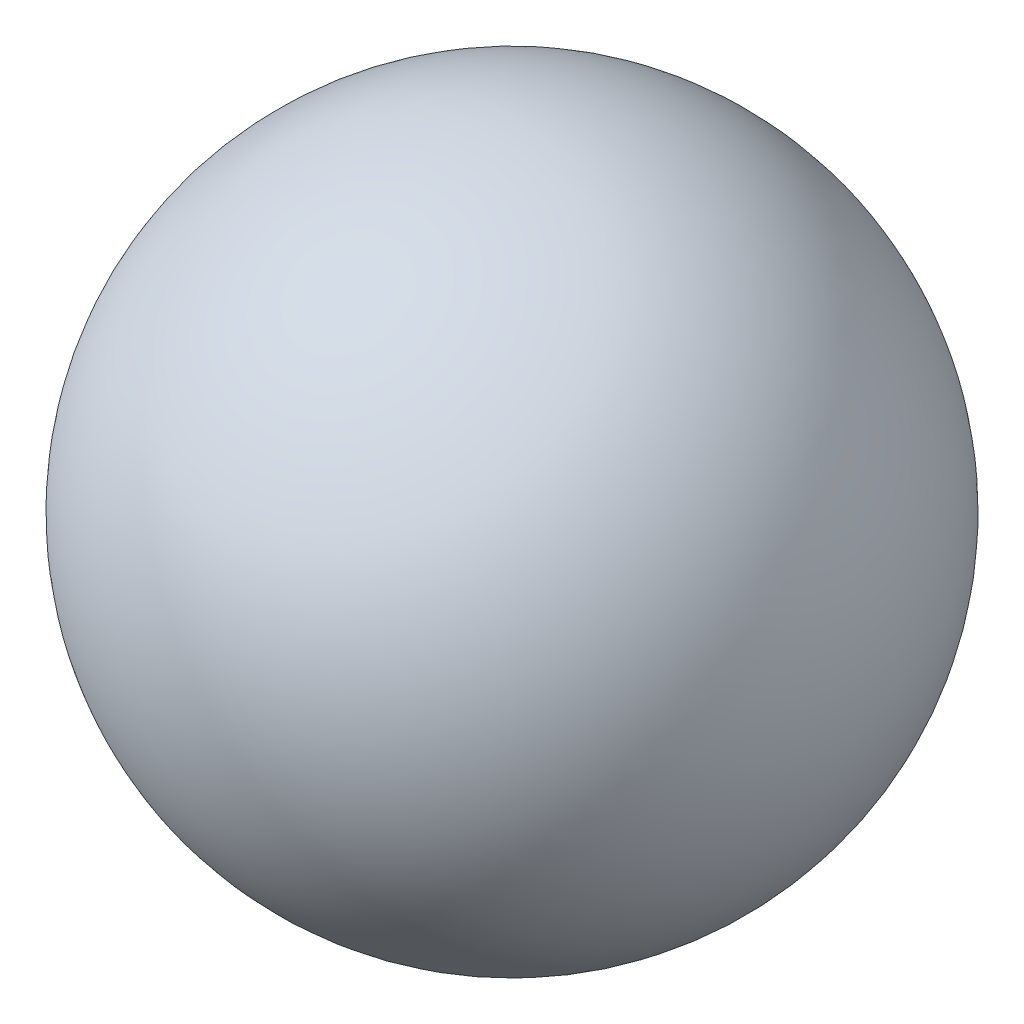
ISO-10303-21;
HEADER;
FILE_DESCRIPTION(('STEP AP214'),'2;1');
FILE_NAME('part.step','',(''),(''),'','','');
FILE_SCHEMA(('AUTOMOTIVE_DESIGN { 1 0 10303 214 1 1 1 1 }'));
ENDSEC;
DATA;
#1=APPLICATION_CONTEXT('core data for automotive mechanical design processes');
#2=APPLICATION_PROTOCOL_DEFINITION('international standard','automotive_design',2000,#1);
#3=PRODUCT_CONTEXT('',#1,'mechanical');
#4=PRODUCT('Part','Part','',(#3));
#5=PRODUCT_RELATED_PRODUCT_CATEGORY('part','',(#4));
#6=PRODUCT_DEFINITION_FORMATION('','',#4);
#7=PRODUCT_DEFINITION_CONTEXT('part definition',#1,'design');
#8=PRODUCT_DEFINITION('design','',#6,#7);
#9=PRODUCT_DEFINITION_SHAPE('','',#8);
#10=(LENGTH_UNIT() NAMED_UNIT(*) SI_UNIT(.MILLI.,.METRE.));
#11=(NAMED_UNIT(*) PLANE_ANGLE_UNIT() SI_UNIT($,.RADIAN.));
#12=(NAMED_UNIT(*) SI_UNIT($,.STERADIAN.) SOLID_ANGLE_UNIT());
#13=UNCERTAINTY_MEASURE_WITH_UNIT(LENGTH_MEASURE(1.E-05),#10,'distance_accuracy_value','');
#14=(GEOMETRIC_REPRESENTATION_CONTEXT(3) GLOBAL_UNCERTAINTY_ASSIGNED_CONTEXT((#13)) GLOBAL_UNIT_ASSIGNED_CONTEXT((#10,
#11,#12)) REPRESENTATION_CONTEXT('',''));
#15=CARTESIAN_POINT('',(0.,0.,0.));
#16=DIRECTION('',(0.,0.,1.));
#17=DIRECTION('',(1.,0.,0.));
#18=AXIS2_PLACEMENT_3D('',#15,#16,#17);
#19=CARTESIAN_POINT('',(11.7366912354003,-2.,0.559087510928994));
#20=DIRECTION('',(0.,0.,1.));
#21=DIRECTION('',(1.,0.,0.));
#22=AXIS2_PLACEMENT_3D('',#19,#20,#21);
#23=SPHERICAL_SURFACE('',#22,1.05);
#24=CARTESIAN_POINT('',(11.7366912354003,-2.,1.60908751092899));
#25=VERTEX_POINT('',#24);
#26=VERTEX_LOOP('',#25);
#27=FACE_BOUND('',#26,.T.);
#28=ADVANCED_FACE('F12',(#27),#23,.T.);
#29=CLOSED_SHELL('',(#28));
#30=MANIFOLD_SOLID_BREP('B1',#29);
#31=ADVANCED_BREP_SHAPE_REPRESENTATION('',(#18,#30),#14);
#32=SHAPE_DEFINITION_REPRESENTATION(#9,#31);
ENDSEC;
END-ISO-10303-21;
